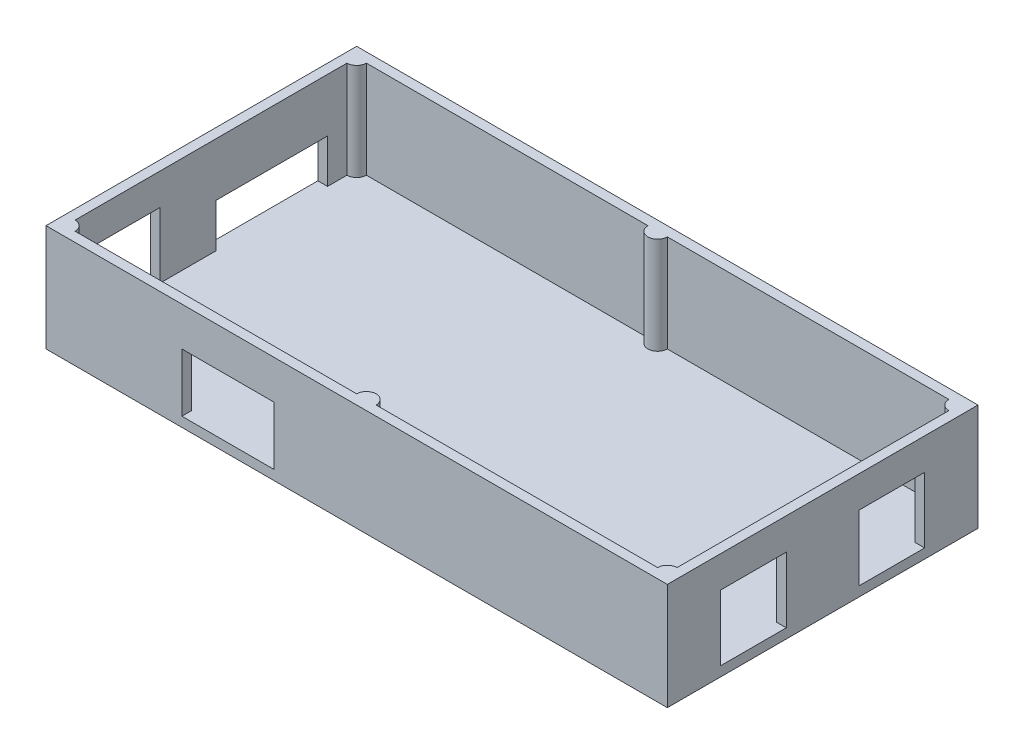
ISO-10303-21;
HEADER;
FILE_DESCRIPTION(('STEP AP214'),'2;1');
FILE_NAME('part.step','',(''),(''),'','','');
FILE_SCHEMA(('AUTOMOTIVE_DESIGN { 1 0 10303 214 1 1 1 1 }'));
ENDSEC;
DATA;
#1=APPLICATION_CONTEXT('core data for automotive mechanical design processes');
#2=APPLICATION_PROTOCOL_DEFINITION('international standard','automotive_design',2000,#1);
#3=PRODUCT_CONTEXT('',#1,'mechanical');
#4=PRODUCT('Part','Part','',(#3));
#5=PRODUCT_RELATED_PRODUCT_CATEGORY('part','',(#4));
#6=PRODUCT_DEFINITION_FORMATION('','',#4);
#7=PRODUCT_DEFINITION_CONTEXT('part definition',#1,'design');
#8=PRODUCT_DEFINITION('design','',#6,#7);
#9=PRODUCT_DEFINITION_SHAPE('','',#8);
#10=(LENGTH_UNIT() NAMED_UNIT(*) SI_UNIT(.MILLI.,.METRE.));
#11=(NAMED_UNIT(*) PLANE_ANGLE_UNIT() SI_UNIT($,.RADIAN.));
#12=(NAMED_UNIT(*) SI_UNIT($,.STERADIAN.) SOLID_ANGLE_UNIT());
#13=UNCERTAINTY_MEASURE_WITH_UNIT(LENGTH_MEASURE(1.E-05),#10,'distance_accuracy_value','');
#14=(GEOMETRIC_REPRESENTATION_CONTEXT(3) GLOBAL_UNCERTAINTY_ASSIGNED_CONTEXT((#13)) GLOBAL_UNIT_ASSIGNED_CONTEXT((#10,
#11,#12)) REPRESENTATION_CONTEXT('',''));
#15=CARTESIAN_POINT('',(0.,0.,0.));
#16=DIRECTION('',(0.,0.,1.));
#17=DIRECTION('',(1.,0.,0.));
#18=AXIS2_PLACEMENT_3D('',#15,#16,#17);
#19=CARTESIAN_POINT('',(0.,22.,30.));
#20=DIRECTION('',(0.,0.,1.));
#21=DIRECTION('',(1.,0.,0.));
#22=AXIS2_PLACEMENT_3D('',#19,#20,#21);
#23=PLANE('',#22);
#24=DIRECTION('',(0.,-1.,0.));
#25=VECTOR('',#24,1.);
#26=CARTESIAN_POINT('',(60.,22.,30.));
#27=LINE('',#26,#25);
#28=CARTESIAN_POINT('',(60.,22.,30.));
#29=VERTEX_POINT('',#28);
#30=CARTESIAN_POINT('',(60.,2.,30.));
#31=VERTEX_POINT('',#30);
#32=EDGE_CURVE('E356',#29,#31,#27,.T.);
#33=ORIENTED_EDGE('',*,*,#32,.T.);
#34=DIRECTION('',(-1.,0.,0.));
#35=VECTOR('',#34,1.);
#36=CARTESIAN_POINT('',(0.,2.,30.));
#37=LINE('',#36,#35);
#38=CARTESIAN_POINT('',(2.,2.,30.));
#39=VERTEX_POINT('',#38);
#40=EDGE_CURVE('E671',#31,#39,#37,.T.);
#41=ORIENTED_EDGE('',*,*,#40,.T.);
#42=DIRECTION('',(0.,-1.,0.));
#43=VECTOR('',#42,1.);
#44=CARTESIAN_POINT('',(2.,22.,30.));
#45=LINE('',#44,#43);
#46=CARTESIAN_POINT('',(2.,22.,30.));
#47=VERTEX_POINT('',#46);
#48=EDGE_CURVE('E11',#47,#39,#45,.T.);
#49=ORIENTED_EDGE('',*,*,#48,.F.);
#50=DIRECTION('',(-1.,0.,0.));
#51=VECTOR('',#50,1.);
#52=CARTESIAN_POINT('',(0.,22.,30.));
#53=LINE('',#52,#51);
#54=EDGE_CURVE('E315',#29,#47,#53,.T.);
#55=ORIENTED_EDGE('',*,*,#54,.F.);
#56=EDGE_LOOP('',(#33,#41,#49,#55));
#57=FACE_BOUND('',#56,.T.);
#58=ADVANCED_FACE('F39',(#57),#23,.F.);
#59=CARTESIAN_POINT('',(0.,22.,30.));
#60=DIRECTION('',(0.,-1.,0.));
#61=DIRECTION('',(0.,0.,-1.));
#62=AXIS2_PLACEMENT_3D('',#59,#60,#61);
#63=CYLINDRICAL_SURFACE('',#62,1.99999999999999);
#64=ORIENTED_EDGE('',*,*,#48,.T.);
#65=CARTESIAN_POINT('',(0.,2.,30.));
#66=DIRECTION('',(0.,1.,0.));
#67=DIRECTION('',(0.,0.,1.));
#68=AXIS2_PLACEMENT_3D('',#65,#66,#67);
#69=CIRCLE('',#68,1.99999999999999);
#70=CARTESIAN_POINT('',(-1.99999999999999,2.,30.));
#71=VERTEX_POINT('',#70);
#72=EDGE_CURVE('E614',#39,#71,#69,.T.);
#73=ORIENTED_EDGE('',*,*,#72,.T.);
#74=DIRECTION('',(0.,-1.,0.));
#75=VECTOR('',#74,1.);
#76=CARTESIAN_POINT('',(-1.99999999999999,22.,30.));
#77=LINE('',#76,#75);
#78=CARTESIAN_POINT('',(-1.99999999999999,22.,30.));
#79=VERTEX_POINT('',#78);
#80=EDGE_CURVE('E48',#79,#71,#77,.T.);
#81=ORIENTED_EDGE('',*,*,#80,.F.);
#82=CARTESIAN_POINT('',(0.,22.,30.));
#83=DIRECTION('',(0.,1.,0.));
#84=DIRECTION('',(0.,0.,1.));
#85=AXIS2_PLACEMENT_3D('',#82,#83,#84);
#86=CIRCLE('',#85,1.99999999999999);
#87=EDGE_CURVE('E318',#47,#79,#86,.T.);
#88=ORIENTED_EDGE('',*,*,#87,.F.);
#89=EDGE_LOOP('',(#64,#73,#81,#88));
#90=FACE_BOUND('',#89,.T.);
#91=ADVANCED_FACE('F421',(#90),#63,.T.);
#92=CARTESIAN_POINT('',(0.,22.,30.));
#93=DIRECTION('',(0.,0.,1.));
#94=DIRECTION('',(1.,0.,0.));
#95=AXIS2_PLACEMENT_3D('',#92,#93,#94);
#96=PLANE('',#95);
#97=DIRECTION('',(-1.,0.,0.));
#98=VECTOR('',#97,1.);
#99=CARTESIAN_POINT('',(-36.,14.,30.));
#100=LINE('',#99,#98);
#101=CARTESIAN_POINT('',(-17.,14.,30.));
#102=VERTEX_POINT('',#101);
#103=CARTESIAN_POINT('',(-36.,14.,30.));
#104=VERTEX_POINT('',#103);
#105=EDGE_CURVE('E282',#102,#104,#100,.T.);
#106=ORIENTED_EDGE('',*,*,#105,.T.);
#107=DIRECTION('',(0.,-1.,0.));
#108=VECTOR('',#107,1.);
#109=CARTESIAN_POINT('',(-36.,2.,30.));
#110=LINE('',#109,#108);
#111=CARTESIAN_POINT('',(-36.,2.,30.));
#112=VERTEX_POINT('',#111);
#113=EDGE_CURVE('E275',#104,#112,#110,.T.);
#114=ORIENTED_EDGE('',*,*,#113,.T.);
#115=DIRECTION('',(-1.,0.,0.));
#116=VECTOR('',#115,1.);
#117=CARTESIAN_POINT('',(0.,2.,30.));
#118=LINE('',#117,#116);
#119=CARTESIAN_POINT('',(-60.,2.,30.));
#120=VERTEX_POINT('',#119);
#121=EDGE_CURVE('E287',#112,#120,#118,.T.);
#122=ORIENTED_EDGE('',*,*,#121,.T.);
#123=DIRECTION('',(0.,-1.,0.));
#124=VECTOR('',#123,1.);
#125=CARTESIAN_POINT('',(-60.,22.,30.));
#126=LINE('',#125,#124);
#127=CARTESIAN_POINT('',(-60.,22.,30.));
#128=VERTEX_POINT('',#127);
#129=EDGE_CURVE('E383',#128,#120,#126,.T.);
#130=ORIENTED_EDGE('',*,*,#129,.F.);
#131=DIRECTION('',(-1.,0.,0.));
#132=VECTOR('',#131,1.);
#133=CARTESIAN_POINT('',(0.,22.,30.));
#134=LINE('',#133,#132);
#135=EDGE_CURVE('E320',#79,#128,#134,.T.);
#136=ORIENTED_EDGE('',*,*,#135,.F.);
#137=ORIENTED_EDGE('',*,*,#80,.T.);
#138=CARTESIAN_POINT('',(-17.,2.,30.));
#139=VERTEX_POINT('',#138);
#140=EDGE_CURVE('E296',#71,#139,#118,.T.);
#141=ORIENTED_EDGE('',*,*,#140,.T.);
#142=DIRECTION('',(0.,1.,0.));
#143=VECTOR('',#142,1.);
#144=CARTESIAN_POINT('',(-17.,2.,30.));
#145=LINE('',#144,#143);
#146=EDGE_CURVE('E64',#139,#102,#145,.T.);
#147=ORIENTED_EDGE('',*,*,#146,.T.);
#148=EDGE_LOOP('',(#106,#114,#122,#130,#136,#137,#141,#147));
#149=FACE_BOUND('',#148,.T.);
#150=ADVANCED_FACE('F285',(#149),#96,.F.);
#151=CARTESIAN_POINT('',(-62.,22.,30.));
#152=DIRECTION('',(0.,-1.,0.));
#153=DIRECTION('',(0.,0.,-1.));
#154=AXIS2_PLACEMENT_3D('',#151,#152,#153);
#155=CYLINDRICAL_SURFACE('',#154,1.99999999999999);
#156=CARTESIAN_POINT('',(-62.,2.,30.));
#157=DIRECTION('',(0.,1.,0.));
#158=DIRECTION('',(0.,0.,1.));
#159=AXIS2_PLACEMENT_3D('',#156,#157,#158);
#160=CIRCLE('',#159,1.99999999999999);
#161=CARTESIAN_POINT('',(-62.,2.,28.));
#162=VERTEX_POINT('',#161);
#163=EDGE_CURVE('E294',#162,#120,#160,.F.);
#164=ORIENTED_EDGE('',*,*,#163,.F.);
#165=DIRECTION('',(0.,-1.,0.));
#166=VECTOR('',#165,1.);
#167=CARTESIAN_POINT('',(-62.,22.,28.));
#168=LINE('',#167,#166);
#169=CARTESIAN_POINT('',(-62.,22.,28.));
#170=VERTEX_POINT('',#169);
#171=EDGE_CURVE('E380',#170,#162,#168,.T.);
#172=ORIENTED_EDGE('',*,*,#171,.F.);
#173=CARTESIAN_POINT('',(-62.,22.,30.));
#174=DIRECTION('',(0.,1.,0.));
#175=DIRECTION('',(0.,0.,1.));
#176=AXIS2_PLACEMENT_3D('',#173,#174,#175);
#177=CIRCLE('',#176,1.99999999999999);
#178=EDGE_CURVE('E322',#170,#128,#177,.F.);
#179=ORIENTED_EDGE('',*,*,#178,.T.);
#180=ORIENTED_EDGE('',*,*,#129,.T.);
#181=EDGE_LOOP('',(#164,#172,#179,#180));
#182=FACE_BOUND('',#181,.T.);
#183=ADVANCED_FACE('F432',(#182),#155,.T.);
#184=CARTESIAN_POINT('',(-62.,22.,0.));
#185=DIRECTION('',(-1.,0.,0.));
#186=DIRECTION('',(0.,0.,1.));
#187=AXIS2_PLACEMENT_3D('',#184,#185,#186);
#188=PLANE('',#187);
#189=DIRECTION('',(0.,0.,-1.));
#190=VECTOR('',#189,1.);
#191=CARTESIAN_POINT('',(-62.,11.,-24.));
#192=LINE('',#191,#190);
#193=CARTESIAN_POINT('',(-62.,11.,-1.));
#194=VERTEX_POINT('',#193);
#195=CARTESIAN_POINT('',(-62.,11.,-24.));
#196=VERTEX_POINT('',#195);
#197=EDGE_CURVE('E560',#194,#196,#192,.T.);
#198=ORIENTED_EDGE('',*,*,#197,.T.);
#199=DIRECTION('',(0.,-1.,0.));
#200=VECTOR('',#199,1.);
#201=CARTESIAN_POINT('',(-62.,2.,-24.));
#202=LINE('',#201,#200);
#203=CARTESIAN_POINT('',(-62.,2.,-24.));
#204=VERTEX_POINT('',#203);
#205=EDGE_CURVE('E553',#196,#204,#202,.T.);
#206=ORIENTED_EDGE('',*,*,#205,.T.);
#207=DIRECTION('',(0.,0.,-1.));
#208=VECTOR('',#207,1.);
#209=CARTESIAN_POINT('',(-62.,2.,0.));
#210=LINE('',#209,#208);
#211=CARTESIAN_POINT('',(-62.,2.,-28.));
#212=VERTEX_POINT('',#211);
#213=EDGE_CURVE('E692',#204,#212,#210,.T.);
#214=ORIENTED_EDGE('',*,*,#213,.T.);
#215=DIRECTION('',(0.,-1.,0.));
#216=VECTOR('',#215,1.);
#217=CARTESIAN_POINT('',(-62.,22.,-28.));
#218=LINE('',#217,#216);
#219=CARTESIAN_POINT('',(-62.,22.,-28.));
#220=VERTEX_POINT('',#219);
#221=EDGE_CURVE('E377',#220,#212,#218,.T.);
#222=ORIENTED_EDGE('',*,*,#221,.F.);
#223=DIRECTION('',(0.,0.,-1.));
#224=VECTOR('',#223,1.);
#225=CARTESIAN_POINT('',(-62.,22.,0.));
#226=LINE('',#225,#224);
#227=EDGE_CURVE('E325',#170,#220,#226,.T.);
#228=ORIENTED_EDGE('',*,*,#227,.F.);
#229=ORIENTED_EDGE('',*,*,#171,.T.);
#230=CARTESIAN_POINT('',(-62.,2.,24.));
#231=VERTEX_POINT('',#230);
#232=EDGE_CURVE('E300',#162,#231,#210,.T.);
#233=ORIENTED_EDGE('',*,*,#232,.T.);
#234=DIRECTION('',(0.,1.,0.));
#235=VECTOR('',#234,1.);
#236=CARTESIAN_POINT('',(-62.,2.00000000000001,24.));
#237=LINE('',#236,#235);
#238=CARTESIAN_POINT('',(-62.,15.5,24.));
#239=VERTEX_POINT('',#238);
#240=EDGE_CURVE('E587',#231,#239,#237,.T.);
#241=ORIENTED_EDGE('',*,*,#240,.T.);
#242=DIRECTION('',(0.,0.,-1.));
#243=VECTOR('',#242,1.);
#244=CARTESIAN_POINT('',(-62.,15.5,10.5));
#245=LINE('',#244,#243);
#246=CARTESIAN_POINT('',(-62.,15.5,10.5));
#247=VERTEX_POINT('',#246);
#248=EDGE_CURVE('E591',#239,#247,#245,.T.);
#249=ORIENTED_EDGE('',*,*,#248,.T.);
#250=DIRECTION('',(0.,-1.,0.));
#251=VECTOR('',#250,1.);
#252=CARTESIAN_POINT('',(-62.,2.,10.5));
#253=LINE('',#252,#251);
#254=CARTESIAN_POINT('',(-62.,2.,10.5));
#255=VERTEX_POINT('',#254);
#256=EDGE_CURVE('E584',#247,#255,#253,.T.);
#257=ORIENTED_EDGE('',*,*,#256,.T.);
#258=CARTESIAN_POINT('',(-62.,2.,-1.));
#259=VERTEX_POINT('',#258);
#260=EDGE_CURVE('E694',#255,#259,#210,.T.);
#261=ORIENTED_EDGE('',*,*,#260,.T.);
#262=DIRECTION('',(0.,1.,0.));
#263=VECTOR('',#262,1.);
#264=CARTESIAN_POINT('',(-62.,2.,-1.));
#265=LINE('',#264,#263);
#266=EDGE_CURVE('E556',#259,#194,#265,.T.);
#267=ORIENTED_EDGE('',*,*,#266,.T.);
#268=EDGE_LOOP('',(#198,#206,#214,#222,#228,#229,#233,#241,#249,#257,#261,#267));
#269=FACE_BOUND('',#268,.T.);
#270=ADVANCED_FACE('F435',(#269),#188,.F.);
#271=CARTESIAN_POINT('',(-62.,22.,-30.));
#272=DIRECTION('',(0.,-1.,0.));
#273=DIRECTION('',(0.,0.,-1.));
#274=AXIS2_PLACEMENT_3D('',#271,#272,#273);
#275=CYLINDRICAL_SURFACE('',#274,2.);
#276=ORIENTED_EDGE('',*,*,#221,.T.);
#277=CARTESIAN_POINT('',(-62.,2.,-30.));
#278=DIRECTION('',(0.,1.,0.));
#279=DIRECTION('',(0.,0.,1.));
#280=AXIS2_PLACEMENT_3D('',#277,#278,#279);
#281=CIRCLE('',#280,2.);
#282=CARTESIAN_POINT('',(-60.,2.,-30.));
#283=VERTEX_POINT('',#282);
#284=EDGE_CURVE('E690',#212,#283,#281,.T.);
#285=ORIENTED_EDGE('',*,*,#284,.T.);
#286=DIRECTION('',(0.,-1.,0.));
#287=VECTOR('',#286,1.);
#288=CARTESIAN_POINT('',(-60.,22.,-30.));
#289=LINE('',#288,#287);
#290=CARTESIAN_POINT('',(-60.,22.,-30.));
#291=VERTEX_POINT('',#290);
#292=EDGE_CURVE('E374',#291,#283,#289,.T.);
#293=ORIENTED_EDGE('',*,*,#292,.F.);
#294=CARTESIAN_POINT('',(-62.,22.,-30.));
#295=DIRECTION('',(0.,1.,0.));
#296=DIRECTION('',(0.,0.,1.));
#297=AXIS2_PLACEMENT_3D('',#294,#295,#296);
#298=CIRCLE('',#297,2.);
#299=EDGE_CURVE('E327',#220,#291,#298,.T.);
#300=ORIENTED_EDGE('',*,*,#299,.F.);
#301=EDGE_LOOP('',(#276,#285,#293,#300));
#302=FACE_BOUND('',#301,.T.);
#303=ADVANCED_FACE('F439',(#302),#275,.T.);
#304=CARTESIAN_POINT('',(0.,22.,-30.));
#305=DIRECTION('',(0.,0.,1.));
#306=DIRECTION('',(1.,0.,0.));
#307=AXIS2_PLACEMENT_3D('',#304,#305,#306);
#308=PLANE('',#307);
#309=DIRECTION('',(-1.,0.,0.));
#310=VECTOR('',#309,1.);
#311=CARTESIAN_POINT('',(0.,2.,-30.));
#312=LINE('',#311,#310);
#313=CARTESIAN_POINT('',(-2.,2.,-30.));
#314=VERTEX_POINT('',#313);
#315=EDGE_CURVE('E688',#314,#283,#312,.T.);
#316=ORIENTED_EDGE('',*,*,#315,.F.);
#317=DIRECTION('',(0.,-1.,0.));
#318=VECTOR('',#317,1.);
#319=CARTESIAN_POINT('',(-2.,22.,-30.));
#320=LINE('',#319,#318);
#321=CARTESIAN_POINT('',(-2.,22.,-30.));
#322=VERTEX_POINT('',#321);
#323=EDGE_CURVE('E371',#322,#314,#320,.T.);
#324=ORIENTED_EDGE('',*,*,#323,.F.);
#325=DIRECTION('',(-1.,0.,0.));
#326=VECTOR('',#325,1.);
#327=CARTESIAN_POINT('',(0.,22.,-30.));
#328=LINE('',#327,#326);
#329=EDGE_CURVE('E329',#322,#291,#328,.T.);
#330=ORIENTED_EDGE('',*,*,#329,.T.);
#331=ORIENTED_EDGE('',*,*,#292,.T.);
#332=EDGE_LOOP('',(#316,#324,#330,#331));
#333=FACE_BOUND('',#332,.T.);
#334=ADVANCED_FACE('F443',(#333),#308,.T.);
#335=CARTESIAN_POINT('',(0.,22.,-30.));
#336=DIRECTION('',(0.,-1.,0.));
#337=DIRECTION('',(0.,0.,-1.));
#338=AXIS2_PLACEMENT_3D('',#335,#336,#337);
#339=CYLINDRICAL_SURFACE('',#338,2.);
#340=CARTESIAN_POINT('',(0.,2.,-30.));
#341=DIRECTION('',(0.,1.,0.));
#342=DIRECTION('',(0.,0.,1.));
#343=AXIS2_PLACEMENT_3D('',#340,#341,#342);
#344=CIRCLE('',#343,2.);
#345=CARTESIAN_POINT('',(2.,2.,-30.));
#346=VERTEX_POINT('',#345);
#347=EDGE_CURVE('E686',#346,#314,#344,.F.);
#348=ORIENTED_EDGE('',*,*,#347,.F.);
#349=DIRECTION('',(0.,-1.,0.));
#350=VECTOR('',#349,1.);
#351=CARTESIAN_POINT('',(2.,22.,-30.));
#352=LINE('',#351,#350);
#353=CARTESIAN_POINT('',(2.,22.,-30.));
#354=VERTEX_POINT('',#353);
#355=EDGE_CURVE('E368',#354,#346,#352,.T.);
#356=ORIENTED_EDGE('',*,*,#355,.F.);
#357=CARTESIAN_POINT('',(0.,22.,-30.));
#358=DIRECTION('',(0.,1.,0.));
#359=DIRECTION('',(0.,0.,1.));
#360=AXIS2_PLACEMENT_3D('',#357,#358,#359);
#361=CIRCLE('',#360,2.);
#362=EDGE_CURVE('E332',#354,#322,#361,.F.);
#363=ORIENTED_EDGE('',*,*,#362,.T.);
#364=ORIENTED_EDGE('',*,*,#323,.T.);
#365=EDGE_LOOP('',(#348,#356,#363,#364));
#366=FACE_BOUND('',#365,.T.);
#367=ADVANCED_FACE('F447',(#366),#339,.T.);
#368=CARTESIAN_POINT('',(0.,22.,-30.));
#369=DIRECTION('',(0.,0.,1.));
#370=DIRECTION('',(1.,0.,0.));
#371=AXIS2_PLACEMENT_3D('',#368,#369,#370);
#372=PLANE('',#371);
#373=DIRECTION('',(-1.,0.,0.));
#374=VECTOR('',#373,1.);
#375=CARTESIAN_POINT('',(0.,2.,-30.));
#376=LINE('',#375,#374);
#377=CARTESIAN_POINT('',(60.,2.,-30.));
#378=VERTEX_POINT('',#377);
#379=EDGE_CURVE('E684',#378,#346,#376,.T.);
#380=ORIENTED_EDGE('',*,*,#379,.F.);
#381=DIRECTION('',(0.,-1.,0.));
#382=VECTOR('',#381,1.);
#383=CARTESIAN_POINT('',(60.,22.,-30.));
#384=LINE('',#383,#382);
#385=CARTESIAN_POINT('',(60.,22.,-30.));
#386=VERTEX_POINT('',#385);
#387=EDGE_CURVE('E365',#386,#378,#384,.T.);
#388=ORIENTED_EDGE('',*,*,#387,.F.);
#389=DIRECTION('',(-1.,0.,0.));
#390=VECTOR('',#389,1.);
#391=CARTESIAN_POINT('',(0.,22.,-30.));
#392=LINE('',#391,#390);
#393=EDGE_CURVE('E335',#386,#354,#392,.T.);
#394=ORIENTED_EDGE('',*,*,#393,.T.);
#395=ORIENTED_EDGE('',*,*,#355,.T.);
#396=EDGE_LOOP('',(#380,#388,#394,#395));
#397=FACE_BOUND('',#396,.T.);
#398=ADVANCED_FACE('F451',(#397),#372,.T.);
#399=CARTESIAN_POINT('',(62.,22.,-30.));
#400=DIRECTION('',(0.,-1.,0.));
#401=DIRECTION('',(0.,0.,-1.));
#402=AXIS2_PLACEMENT_3D('',#399,#400,#401);
#403=CYLINDRICAL_SURFACE('',#402,1.99999999999999);
#404=CARTESIAN_POINT('',(62.,2.,-30.));
#405=DIRECTION('',(0.,1.,0.));
#406=DIRECTION('',(0.,0.,1.));
#407=AXIS2_PLACEMENT_3D('',#404,#405,#406);
#408=CIRCLE('',#407,1.99999999999999);
#409=CARTESIAN_POINT('',(62.,2.,-28.));
#410=VERTEX_POINT('',#409);
#411=EDGE_CURVE('E681',#410,#378,#408,.F.);
#412=ORIENTED_EDGE('',*,*,#411,.F.);
#413=DIRECTION('',(0.,-1.,0.));
#414=VECTOR('',#413,1.);
#415=CARTESIAN_POINT('',(62.,22.,-28.));
#416=LINE('',#415,#414);
#417=CARTESIAN_POINT('',(62.,22.,-28.));
#418=VERTEX_POINT('',#417);
#419=EDGE_CURVE('E362',#418,#410,#416,.T.);
#420=ORIENTED_EDGE('',*,*,#419,.F.);
#421=CARTESIAN_POINT('',(62.,22.,-30.));
#422=DIRECTION('',(0.,1.,0.));
#423=DIRECTION('',(0.,0.,1.));
#424=AXIS2_PLACEMENT_3D('',#421,#422,#423);
#425=CIRCLE('',#424,1.99999999999999);
#426=EDGE_CURVE('E338',#418,#386,#425,.F.);
#427=ORIENTED_EDGE('',*,*,#426,.T.);
#428=ORIENTED_EDGE('',*,*,#387,.T.);
#429=EDGE_LOOP('',(#412,#420,#427,#428));
#430=FACE_BOUND('',#429,.T.);
#431=ADVANCED_FACE('F455',(#430),#403,.T.);
#432=CARTESIAN_POINT('',(62.,22.,0.));
#433=DIRECTION('',(-1.,0.,0.));
#434=DIRECTION('',(0.,0.,1.));
#435=AXIS2_PLACEMENT_3D('',#432,#433,#434);
#436=PLANE('',#435);
#437=DIRECTION('',(0.,-1.,0.));
#438=VECTOR('',#437,1.);
#439=CARTESIAN_POINT('',(62.,2.,21.));
#440=LINE('',#439,#438);
#441=CARTESIAN_POINT('',(62.,15.5,21.));
#442=VERTEX_POINT('',#441);
#443=CARTESIAN_POINT('',(62.,2.,21.));
#444=VERTEX_POINT('',#443);
#445=EDGE_CURVE('E624',#442,#444,#440,.T.);
#446=ORIENTED_EDGE('',*,*,#445,.T.);
#447=DIRECTION('',(0.,0.,-1.));
#448=VECTOR('',#447,1.);
#449=CARTESIAN_POINT('',(62.,2.,0.));
#450=LINE('',#449,#448);
#451=CARTESIAN_POINT('',(62.,2.,28.));
#452=VERTEX_POINT('',#451);
#453=EDGE_CURVE('E678',#452,#444,#450,.T.);
#454=ORIENTED_EDGE('',*,*,#453,.F.);
#455=DIRECTION('',(0.,-1.,0.));
#456=VECTOR('',#455,1.);
#457=CARTESIAN_POINT('',(62.,22.,28.));
#458=LINE('',#457,#456);
#459=CARTESIAN_POINT('',(62.,22.,28.));
#460=VERTEX_POINT('',#459);
#461=EDGE_CURVE('E359',#460,#452,#458,.T.);
#462=ORIENTED_EDGE('',*,*,#461,.F.);
#463=DIRECTION('',(0.,0.,-1.));
#464=VECTOR('',#463,1.);
#465=CARTESIAN_POINT('',(62.,22.,0.));
#466=LINE('',#465,#464);
#467=EDGE_CURVE('E341',#460,#418,#466,.T.);
#468=ORIENTED_EDGE('',*,*,#467,.T.);
#469=ORIENTED_EDGE('',*,*,#419,.T.);
#470=CARTESIAN_POINT('',(62.,2.,-21.));
#471=VERTEX_POINT('',#470);
#472=EDGE_CURVE('E677',#471,#410,#450,.T.);
#473=ORIENTED_EDGE('',*,*,#472,.F.);
#474=DIRECTION('',(0.,1.,0.));
#475=VECTOR('',#474,1.);
#476=CARTESIAN_POINT('',(62.,2.,-21.));
#477=LINE('',#476,#475);
#478=CARTESIAN_POINT('',(62.,15.5,-21.));
#479=VERTEX_POINT('',#478);
#480=EDGE_CURVE('E642',#471,#479,#477,.T.);
#481=ORIENTED_EDGE('',*,*,#480,.T.);
#482=DIRECTION('',(0.,0.,1.));
#483=VECTOR('',#482,1.);
#484=CARTESIAN_POINT('',(62.,15.5,-21.));
#485=LINE('',#484,#483);
#486=CARTESIAN_POINT('',(62.,15.5,-7.50000000000001));
#487=VERTEX_POINT('',#486);
#488=EDGE_CURVE('E661',#479,#487,#485,.T.);
#489=ORIENTED_EDGE('',*,*,#488,.T.);
#490=DIRECTION('',(0.,-1.,0.));
#491=VECTOR('',#490,1.);
#492=CARTESIAN_POINT('',(62.,2.,-7.50000000000001));
#493=LINE('',#492,#491);
#494=CARTESIAN_POINT('',(62.,2.,-7.50000000000001));
#495=VERTEX_POINT('',#494);
#496=EDGE_CURVE('E657',#487,#495,#493,.T.);
#497=ORIENTED_EDGE('',*,*,#496,.T.);
#498=CARTESIAN_POINT('',(62.,2.,7.49999999999998));
#499=VERTEX_POINT('',#498);
#500=EDGE_CURVE('E682',#499,#495,#450,.T.);
#501=ORIENTED_EDGE('',*,*,#500,.F.);
#502=DIRECTION('',(0.,1.,0.));
#503=VECTOR('',#502,1.);
#504=CARTESIAN_POINT('',(62.,2.,7.49999999999998));
#505=LINE('',#504,#503);
#506=CARTESIAN_POINT('',(62.,15.5,7.49999999999998));
#507=VERTEX_POINT('',#506);
#508=EDGE_CURVE('E633',#499,#507,#505,.T.);
#509=ORIENTED_EDGE('',*,*,#508,.T.);
#510=DIRECTION('',(0.,0.,1.));
#511=VECTOR('',#510,1.);
#512=CARTESIAN_POINT('',(62.,15.5,21.));
#513=LINE('',#512,#511);
#514=EDGE_CURVE('E629',#507,#442,#513,.T.);
#515=ORIENTED_EDGE('',*,*,#514,.T.);
#516=EDGE_LOOP('',(#446,#454,#462,#468,#469,#473,#481,#489,#497,#501,#509,#515));
#517=FACE_BOUND('',#516,.T.);
#518=ADVANCED_FACE('F459',(#517),#436,.T.);
#519=CARTESIAN_POINT('',(0.,22.,32.));
#520=DIRECTION('',(0.,0.,1.));
#521=DIRECTION('',(1.,0.,0.));
#522=AXIS2_PLACEMENT_3D('',#519,#520,#521);
#523=PLANE('',#522);
#524=DIRECTION('',(0.,-1.,0.));
#525=VECTOR('',#524,1.);
#526=CARTESIAN_POINT('',(-36.,2.,32.));
#527=LINE('',#526,#525);
#528=CARTESIAN_POINT('',(-36.,14.,32.));
#529=VERTEX_POINT('',#528);
#530=CARTESIAN_POINT('',(-36.,1.99999999999999,32.));
#531=VERTEX_POINT('',#530);
#532=EDGE_CURVE('E56',#529,#531,#527,.T.);
#533=ORIENTED_EDGE('',*,*,#532,.F.);
#534=DIRECTION('',(-1.,0.,0.));
#535=VECTOR('',#534,1.);
#536=CARTESIAN_POINT('',(-36.,14.,32.));
#537=LINE('',#536,#535);
#538=CARTESIAN_POINT('',(-17.,14.,32.));
#539=VERTEX_POINT('',#538);
#540=EDGE_CURVE('E290',#539,#529,#537,.T.);
#541=ORIENTED_EDGE('',*,*,#540,.F.);
#542=DIRECTION('',(0.,1.,0.));
#543=VECTOR('',#542,1.);
#544=CARTESIAN_POINT('',(-17.,2.,32.));
#545=LINE('',#544,#543);
#546=CARTESIAN_POINT('',(-17.,2.,32.));
#547=VERTEX_POINT('',#546);
#548=EDGE_CURVE('E540',#547,#539,#545,.T.);
#549=ORIENTED_EDGE('',*,*,#548,.F.);
#550=DIRECTION('',(1.,0.,0.));
#551=VECTOR('',#550,1.);
#552=CARTESIAN_POINT('',(-36.,2.,32.));
#553=LINE('',#552,#551);
#554=EDGE_CURVE('E542',#531,#547,#553,.T.);
#555=ORIENTED_EDGE('',*,*,#554,.F.);
#556=EDGE_LOOP('',(#533,#541,#549,#555));
#557=FACE_BOUND('',#556,.T.);
#558=DIRECTION('',(-1.,0.,0.));
#559=VECTOR('',#558,1.);
#560=CARTESIAN_POINT('',(0.,0.,32.));
#561=LINE('',#560,#559);
#562=CARTESIAN_POINT('',(64.,0.,32.));
#563=VERTEX_POINT('',#562);
#564=CARTESIAN_POINT('',(-64.,0.,32.));
#565=VERTEX_POINT('',#564);
#566=EDGE_CURVE('E299',#563,#565,#561,.T.);
#567=ORIENTED_EDGE('',*,*,#566,.F.);
#568=DIRECTION('',(0.,-1.,0.));
#569=VECTOR('',#568,1.);
#570=CARTESIAN_POINT('',(64.,22.,32.));
#571=LINE('',#570,#569);
#572=CARTESIAN_POINT('',(64.,22.,32.));
#573=VERTEX_POINT('',#572);
#574=EDGE_CURVE('E43',#573,#563,#571,.T.);
#575=ORIENTED_EDGE('',*,*,#574,.F.);
#576=DIRECTION('',(-1.,0.,0.));
#577=VECTOR('',#576,1.);
#578=CARTESIAN_POINT('',(0.,22.,32.));
#579=LINE('',#578,#577);
#580=CARTESIAN_POINT('',(-64.,22.,32.));
#581=VERTEX_POINT('',#580);
#582=EDGE_CURVE('E304',#573,#581,#579,.T.);
#583=ORIENTED_EDGE('',*,*,#582,.T.);
#584=DIRECTION('',(0.,-1.,0.));
#585=VECTOR('',#584,1.);
#586=CARTESIAN_POINT('',(-64.,22.,32.));
#587=LINE('',#586,#585);
#588=EDGE_CURVE('E346',#581,#565,#587,.T.);
#589=ORIENTED_EDGE('',*,*,#588,.T.);
#590=EDGE_LOOP('',(#567,#575,#583,#589));
#591=FACE_BOUND('',#590,.T.);
#592=ADVANCED_FACE('F41',(#557,#591),#523,.T.);
#593=CARTESIAN_POINT('',(64.,22.,0.));
#594=DIRECTION('',(-1.,0.,0.));
#595=DIRECTION('',(0.,0.,1.));
#596=AXIS2_PLACEMENT_3D('',#593,#594,#595);
#597=PLANE('',#596);
#598=DIRECTION('',(0.,0.,-1.));
#599=VECTOR('',#598,1.);
#600=CARTESIAN_POINT('',(64.,2.,21.));
#601=LINE('',#600,#599);
#602=CARTESIAN_POINT('',(64.,2.,21.));
#603=VERTEX_POINT('',#602);
#604=CARTESIAN_POINT('',(64.,2.,7.49999999999998));
#605=VERTEX_POINT('',#604);
#606=EDGE_CURVE('E618',#603,#605,#601,.T.);
#607=ORIENTED_EDGE('',*,*,#606,.F.);
#608=DIRECTION('',(0.,-1.,0.));
#609=VECTOR('',#608,1.);
#610=CARTESIAN_POINT('',(64.,2.,21.));
#611=LINE('',#610,#609);
#612=CARTESIAN_POINT('',(64.,15.5,21.));
#613=VERTEX_POINT('',#612);
#614=EDGE_CURVE('E621',#613,#603,#611,.T.);
#615=ORIENTED_EDGE('',*,*,#614,.F.);
#616=DIRECTION('',(0.,0.,1.));
#617=VECTOR('',#616,1.);
#618=CARTESIAN_POINT('',(64.,15.5,21.));
#619=LINE('',#618,#617);
#620=CARTESIAN_POINT('',(64.,15.5,7.49999999999998));
#621=VERTEX_POINT('',#620);
#622=EDGE_CURVE('E611',#621,#613,#619,.T.);
#623=ORIENTED_EDGE('',*,*,#622,.F.);
#624=DIRECTION('',(0.,1.,0.));
#625=VECTOR('',#624,1.);
#626=CARTESIAN_POINT('',(64.,2.,7.49999999999998));
#627=LINE('',#626,#625);
#628=EDGE_CURVE('E615',#605,#621,#627,.T.);
#629=ORIENTED_EDGE('',*,*,#628,.F.);
#630=EDGE_LOOP('',(#607,#615,#623,#629));
#631=FACE_BOUND('',#630,.T.);
#632=DIRECTION('',(0.,1.,0.));
#633=VECTOR('',#632,1.);
#634=CARTESIAN_POINT('',(64.,2.,-21.));
#635=LINE('',#634,#633);
#636=CARTESIAN_POINT('',(64.,2.00000000000001,-21.));
#637=VERTEX_POINT('',#636);
#638=CARTESIAN_POINT('',(64.,15.5,-21.));
#639=VERTEX_POINT('',#638);
#640=EDGE_CURVE('E652',#637,#639,#635,.T.);
#641=ORIENTED_EDGE('',*,*,#640,.F.);
#642=DIRECTION('',(0.,0.,-1.));
#643=VECTOR('',#642,1.);
#644=CARTESIAN_POINT('',(64.,2.,-21.));
#645=LINE('',#644,#643);
#646=CARTESIAN_POINT('',(64.,2.,-7.50000000000001));
#647=VERTEX_POINT('',#646);
#648=EDGE_CURVE('E655',#647,#637,#645,.T.);
#649=ORIENTED_EDGE('',*,*,#648,.F.);
#650=DIRECTION('',(0.,-1.,0.));
#651=VECTOR('',#650,1.);
#652=CARTESIAN_POINT('',(64.,2.,-7.50000000000001));
#653=LINE('',#652,#651);
#654=CARTESIAN_POINT('',(64.,15.5,-7.50000000000001));
#655=VERTEX_POINT('',#654);
#656=EDGE_CURVE('E628',#655,#647,#653,.T.);
#657=ORIENTED_EDGE('',*,*,#656,.F.);
#658=DIRECTION('',(0.,0.,1.));
#659=VECTOR('',#658,1.);
#660=CARTESIAN_POINT('',(64.,15.5,-21.));
#661=LINE('',#660,#659);
#662=EDGE_CURVE('E649',#639,#655,#661,.T.);
#663=ORIENTED_EDGE('',*,*,#662,.F.);
#664=EDGE_LOOP('',(#641,#649,#657,#663));
#665=FACE_BOUND('',#664,.T.);
#666=DIRECTION('',(0.,0.,-1.));
#667=VECTOR('',#666,1.);
#668=CARTESIAN_POINT('',(64.,0.,0.));
#669=LINE('',#668,#667);
#670=CARTESIAN_POINT('',(64.,0.,-32.));
#671=VERTEX_POINT('',#670);
#672=EDGE_CURVE('E349',#563,#671,#669,.T.);
#673=ORIENTED_EDGE('',*,*,#672,.T.);
#674=DIRECTION('',(0.,-1.,0.));
#675=VECTOR('',#674,1.);
#676=CARTESIAN_POINT('',(64.,22.,-32.));
#677=LINE('',#676,#675);
#678=CARTESIAN_POINT('',(64.,22.,-32.));
#679=VERTEX_POINT('',#678);
#680=EDGE_CURVE('E389',#679,#671,#677,.T.);
#681=ORIENTED_EDGE('',*,*,#680,.F.);
#682=DIRECTION('',(0.,0.,-1.));
#683=VECTOR('',#682,1.);
#684=CARTESIAN_POINT('',(64.,22.,0.));
#685=LINE('',#684,#683);
#686=EDGE_CURVE('E307',#573,#679,#685,.T.);
#687=ORIENTED_EDGE('',*,*,#686,.F.);
#688=ORIENTED_EDGE('',*,*,#574,.T.);
#689=EDGE_LOOP('',(#673,#681,#687,#688));
#690=FACE_BOUND('',#689,.T.);
#691=ADVANCED_FACE('F398',(#631,#665,#690),#597,.F.);
#692=CARTESIAN_POINT('',(0.,22.,-32.));
#693=DIRECTION('',(0.,0.,1.));
#694=DIRECTION('',(1.,0.,0.));
#695=AXIS2_PLACEMENT_3D('',#692,#693,#694);
#696=PLANE('',#695);
#697=DIRECTION('',(-1.,0.,0.));
#698=VECTOR('',#697,1.);
#699=CARTESIAN_POINT('',(0.,0.,-32.));
#700=LINE('',#699,#698);
#701=CARTESIAN_POINT('',(-64.,0.,-32.));
#702=VERTEX_POINT('',#701);
#703=EDGE_CURVE('E351',#671,#702,#700,.T.);
#704=ORIENTED_EDGE('',*,*,#703,.T.);
#705=DIRECTION('',(0.,-1.,0.));
#706=VECTOR('',#705,1.);
#707=CARTESIAN_POINT('',(-64.,22.,-32.));
#708=LINE('',#707,#706);
#709=CARTESIAN_POINT('',(-64.,22.,-32.));
#710=VERTEX_POINT('',#709);
#711=EDGE_CURVE('E388',#710,#702,#708,.T.);
#712=ORIENTED_EDGE('',*,*,#711,.F.);
#713=DIRECTION('',(-1.,0.,0.));
#714=VECTOR('',#713,1.);
#715=CARTESIAN_POINT('',(0.,22.,-32.));
#716=LINE('',#715,#714);
#717=EDGE_CURVE('E310',#679,#710,#716,.T.);
#718=ORIENTED_EDGE('',*,*,#717,.F.);
#719=ORIENTED_EDGE('',*,*,#680,.T.);
#720=EDGE_LOOP('',(#704,#712,#718,#719));
#721=FACE_BOUND('',#720,.T.);
#722=ADVANCED_FACE('F409',(#721),#696,.F.);
#723=CARTESIAN_POINT('',(-64.,22.,0.));
#724=DIRECTION('',(-1.,0.,0.));
#725=DIRECTION('',(0.,0.,1.));
#726=AXIS2_PLACEMENT_3D('',#723,#724,#725);
#727=PLANE('',#726);
#728=DIRECTION('',(0.,-1.,0.));
#729=VECTOR('',#728,1.);
#730=CARTESIAN_POINT('',(-64.,2.,-24.));
#731=LINE('',#730,#729);
#732=CARTESIAN_POINT('',(-64.,11.,-24.));
#733=VERTEX_POINT('',#732);
#734=CARTESIAN_POINT('',(-64.,2.,-24.));
#735=VERTEX_POINT('',#734);
#736=EDGE_CURVE('E564',#733,#735,#731,.T.);
#737=ORIENTED_EDGE('',*,*,#736,.F.);
#738=DIRECTION('',(0.,0.,-1.));
#739=VECTOR('',#738,1.);
#740=CARTESIAN_POINT('',(-64.,11.,-24.));
#741=LINE('',#740,#739);
#742=CARTESIAN_POINT('',(-64.,11.,-1.));
#743=VERTEX_POINT('',#742);
#744=EDGE_CURVE('E557',#743,#733,#741,.T.);
#745=ORIENTED_EDGE('',*,*,#744,.F.);
#746=DIRECTION('',(0.,1.,0.));
#747=VECTOR('',#746,1.);
#748=CARTESIAN_POINT('',(-64.,2.,-1.));
#749=LINE('',#748,#747);
#750=CARTESIAN_POINT('',(-64.,2.,-1.));
#751=VERTEX_POINT('',#750);
#752=EDGE_CURVE('E570',#751,#743,#749,.T.);
#753=ORIENTED_EDGE('',*,*,#752,.F.);
#754=DIRECTION('',(0.,0.,1.));
#755=VECTOR('',#754,1.);
#756=CARTESIAN_POINT('',(-64.,2.,-24.));
#757=LINE('',#756,#755);
#758=EDGE_CURVE('E566',#735,#751,#757,.T.);
#759=ORIENTED_EDGE('',*,*,#758,.F.);
#760=EDGE_LOOP('',(#737,#745,#753,#759));
#761=FACE_BOUND('',#760,.T.);
#762=DIRECTION('',(0.,-1.,0.));
#763=VECTOR('',#762,1.);
#764=CARTESIAN_POINT('',(-64.,2.,10.5));
#765=LINE('',#764,#763);
#766=CARTESIAN_POINT('',(-64.,15.5,10.5));
#767=VERTEX_POINT('',#766);
#768=CARTESIAN_POINT('',(-64.,2.,10.5));
#769=VERTEX_POINT('',#768);
#770=EDGE_CURVE('E550',#767,#769,#765,.T.);
#771=ORIENTED_EDGE('',*,*,#770,.F.);
#772=DIRECTION('',(0.,0.,-1.));
#773=VECTOR('',#772,1.);
#774=CARTESIAN_POINT('',(-64.,15.5,10.5));
#775=LINE('',#774,#773);
#776=CARTESIAN_POINT('',(-64.,15.5,24.));
#777=VERTEX_POINT('',#776);
#778=EDGE_CURVE('E588',#777,#767,#775,.T.);
#779=ORIENTED_EDGE('',*,*,#778,.F.);
#780=DIRECTION('',(0.,1.,0.));
#781=VECTOR('',#780,1.);
#782=CARTESIAN_POINT('',(-64.,2.00000000000001,24.));
#783=LINE('',#782,#781);
#784=CARTESIAN_POINT('',(-64.,2.00000000000001,24.));
#785=VERTEX_POINT('',#784);
#786=EDGE_CURVE('E599',#785,#777,#783,.T.);
#787=ORIENTED_EDGE('',*,*,#786,.F.);
#788=DIRECTION('',(0.,0.,1.));
#789=VECTOR('',#788,1.);
#790=CARTESIAN_POINT('',(-64.,2.,10.5));
#791=LINE('',#790,#789);
#792=EDGE_CURVE('E596',#769,#785,#791,.T.);
#793=ORIENTED_EDGE('',*,*,#792,.F.);
#794=EDGE_LOOP('',(#771,#779,#787,#793));
#795=FACE_BOUND('',#794,.T.);
#796=DIRECTION('',(0.,0.,-1.));
#797=VECTOR('',#796,1.);
#798=CARTESIAN_POINT('',(-64.,0.,0.));
#799=LINE('',#798,#797);
#800=EDGE_CURVE('E308',#565,#702,#799,.T.);
#801=ORIENTED_EDGE('',*,*,#800,.F.);
#802=ORIENTED_EDGE('',*,*,#588,.F.);
#803=DIRECTION('',(0.,0.,-1.));
#804=VECTOR('',#803,1.);
#805=CARTESIAN_POINT('',(-64.,22.,0.));
#806=LINE('',#805,#804);
#807=EDGE_CURVE('E312',#581,#710,#806,.T.);
#808=ORIENTED_EDGE('',*,*,#807,.T.);
#809=ORIENTED_EDGE('',*,*,#711,.T.);
#810=EDGE_LOOP('',(#801,#802,#808,#809));
#811=FACE_BOUND('',#810,.T.);
#812=ADVANCED_FACE('F407',(#761,#795,#811),#727,.T.);
#813=CARTESIAN_POINT('',(62.,22.,30.));
#814=DIRECTION('',(0.,-1.,0.));
#815=DIRECTION('',(0.,0.,-1.));
#816=AXIS2_PLACEMENT_3D('',#813,#814,#815);
#817=CYLINDRICAL_SURFACE('',#816,1.99999999999999);
#818=ORIENTED_EDGE('',*,*,#461,.T.);
#819=CARTESIAN_POINT('',(62.,2.,30.));
#820=DIRECTION('',(0.,1.,0.));
#821=DIRECTION('',(0.,0.,1.));
#822=AXIS2_PLACEMENT_3D('',#819,#820,#821);
#823=CIRCLE('',#822,1.99999999999999);
#824=EDGE_CURVE('E674',#452,#31,#823,.T.);
#825=ORIENTED_EDGE('',*,*,#824,.T.);
#826=ORIENTED_EDGE('',*,*,#32,.F.);
#827=CARTESIAN_POINT('',(62.,22.,30.));
#828=DIRECTION('',(0.,1.,0.));
#829=DIRECTION('',(0.,0.,1.));
#830=AXIS2_PLACEMENT_3D('',#827,#828,#829);
#831=CIRCLE('',#830,1.99999999999999);
#832=EDGE_CURVE('E344',#460,#29,#831,.T.);
#833=ORIENTED_EDGE('',*,*,#832,.F.);
#834=EDGE_LOOP('',(#818,#825,#826,#833));
#835=FACE_BOUND('',#834,.T.);
#836=ADVANCED_FACE('F416',(#835),#817,.T.);
#837=CARTESIAN_POINT('',(0.,22.,0.));
#838=DIRECTION('',(0.,1.,0.));
#839=DIRECTION('',(0.,0.,1.));
#840=AXIS2_PLACEMENT_3D('',#837,#838,#839);
#841=PLANE('',#840);
#842=ORIENTED_EDGE('',*,*,#582,.F.);
#843=ORIENTED_EDGE('',*,*,#686,.T.);
#844=ORIENTED_EDGE('',*,*,#717,.T.);
#845=ORIENTED_EDGE('',*,*,#807,.F.);
#846=EDGE_LOOP('',(#842,#843,#844,#845));
#847=FACE_BOUND('',#846,.T.);
#848=ORIENTED_EDGE('',*,*,#54,.T.);
#849=ORIENTED_EDGE('',*,*,#87,.T.);
#850=ORIENTED_EDGE('',*,*,#135,.T.);
#851=ORIENTED_EDGE('',*,*,#178,.F.);
#852=ORIENTED_EDGE('',*,*,#227,.T.);
#853=ORIENTED_EDGE('',*,*,#299,.T.);
#854=ORIENTED_EDGE('',*,*,#329,.F.);
#855=ORIENTED_EDGE('',*,*,#362,.F.);
#856=ORIENTED_EDGE('',*,*,#393,.F.);
#857=ORIENTED_EDGE('',*,*,#426,.F.);
#858=ORIENTED_EDGE('',*,*,#467,.F.);
#859=ORIENTED_EDGE('',*,*,#832,.T.);
#860=EDGE_LOOP('',(#848,#849,#850,#851,#852,#853,#854,#855,#856,#857,#858,#859));
#861=FACE_BOUND('',#860,.T.);
#862=ADVANCED_FACE('F466',(#847,#861),#841,.T.);
#863=CARTESIAN_POINT('',(0.,0.,0.));
#864=DIRECTION('',(0.,1.,0.));
#865=DIRECTION('',(0.,0.,1.));
#866=AXIS2_PLACEMENT_3D('',#863,#864,#865);
#867=PLANE('',#866);
#868=ORIENTED_EDGE('',*,*,#566,.T.);
#869=ORIENTED_EDGE('',*,*,#800,.T.);
#870=ORIENTED_EDGE('',*,*,#703,.F.);
#871=ORIENTED_EDGE('',*,*,#672,.F.);
#872=EDGE_LOOP('',(#868,#869,#870,#871));
#873=FACE_BOUND('',#872,.T.);
#874=ADVANCED_FACE('F403',(#873),#867,.F.);
#875=CARTESIAN_POINT('',(0.,2.,0.));
#876=DIRECTION('',(0.,1.,0.));
#877=DIRECTION('',(0.,0.,1.));
#878=AXIS2_PLACEMENT_3D('',#875,#876,#877);
#879=PLANE('',#878);
#880=ORIENTED_EDGE('',*,*,#72,.F.);
#881=ORIENTED_EDGE('',*,*,#40,.F.);
#882=ORIENTED_EDGE('',*,*,#824,.F.);
#883=ORIENTED_EDGE('',*,*,#453,.T.);
#884=DIRECTION('',(1.,0.,0.));
#885=VECTOR('',#884,1.);
#886=CARTESIAN_POINT('',(-64.001,2.,21.));
#887=LINE('',#886,#885);
#888=EDGE_CURVE('E627',#444,#603,#887,.T.);
#889=ORIENTED_EDGE('',*,*,#888,.T.);
#890=ORIENTED_EDGE('',*,*,#606,.T.);
#891=DIRECTION('',(1.,0.,0.));
#892=VECTOR('',#891,1.);
#893=CARTESIAN_POINT('',(-64.001,2.,7.49999999999998));
#894=LINE('',#893,#892);
#895=EDGE_CURVE('E623',#499,#605,#894,.T.);
#896=ORIENTED_EDGE('',*,*,#895,.F.);
#897=ORIENTED_EDGE('',*,*,#500,.T.);
#898=DIRECTION('',(1.,0.,0.));
#899=VECTOR('',#898,1.);
#900=CARTESIAN_POINT('',(-64.001,2.,-7.50000000000001));
#901=LINE('',#900,#899);
#902=EDGE_CURVE('E660',#495,#647,#901,.T.);
#903=ORIENTED_EDGE('',*,*,#902,.T.);
#904=ORIENTED_EDGE('',*,*,#648,.T.);
#905=DIRECTION('',(1.,0.,0.));
#906=VECTOR('',#905,1.);
#907=CARTESIAN_POINT('',(-64.001,2.,-21.));
#908=LINE('',#907,#906);
#909=EDGE_CURVE('E577',#471,#637,#908,.T.);
#910=ORIENTED_EDGE('',*,*,#909,.F.);
#911=ORIENTED_EDGE('',*,*,#472,.T.);
#912=ORIENTED_EDGE('',*,*,#411,.T.);
#913=ORIENTED_EDGE('',*,*,#379,.T.);
#914=ORIENTED_EDGE('',*,*,#347,.T.);
#915=ORIENTED_EDGE('',*,*,#315,.T.);
#916=ORIENTED_EDGE('',*,*,#284,.F.);
#917=ORIENTED_EDGE('',*,*,#213,.F.);
#918=DIRECTION('',(-1.,0.,0.));
#919=VECTOR('',#918,1.);
#920=CARTESIAN_POINT('',(-62.,2.,-24.));
#921=LINE('',#920,#919);
#922=EDGE_CURVE('E563',#204,#735,#921,.T.);
#923=ORIENTED_EDGE('',*,*,#922,.T.);
#924=ORIENTED_EDGE('',*,*,#758,.T.);
#925=DIRECTION('',(-1.,0.,0.));
#926=VECTOR('',#925,1.);
#927=CARTESIAN_POINT('',(-62.,2.,-1.));
#928=LINE('',#927,#926);
#929=EDGE_CURVE('E580',#259,#751,#928,.T.);
#930=ORIENTED_EDGE('',*,*,#929,.F.);
#931=ORIENTED_EDGE('',*,*,#260,.F.);
#932=DIRECTION('',(-1.,0.,0.));
#933=VECTOR('',#932,1.);
#934=CARTESIAN_POINT('',(-62.,2.,10.5));
#935=LINE('',#934,#933);
#936=EDGE_CURVE('E594',#255,#769,#935,.T.);
#937=ORIENTED_EDGE('',*,*,#936,.T.);
#938=ORIENTED_EDGE('',*,*,#792,.T.);
#939=DIRECTION('',(-1.,0.,0.));
#940=VECTOR('',#939,1.);
#941=CARTESIAN_POINT('',(-62.,2.00000000000001,24.));
#942=LINE('',#941,#940);
#943=EDGE_CURVE('E607',#231,#785,#942,.T.);
#944=ORIENTED_EDGE('',*,*,#943,.F.);
#945=ORIENTED_EDGE('',*,*,#232,.F.);
#946=ORIENTED_EDGE('',*,*,#163,.T.);
#947=ORIENTED_EDGE('',*,*,#121,.F.);
#948=DIRECTION('',(0.,0.,1.));
#949=VECTOR('',#948,1.);
#950=CARTESIAN_POINT('',(-36.,2.,30.));
#951=LINE('',#950,#949);
#952=EDGE_CURVE('E272',#112,#531,#951,.T.);
#953=ORIENTED_EDGE('',*,*,#952,.T.);
#954=ORIENTED_EDGE('',*,*,#554,.T.);
#955=DIRECTION('',(0.,0.,1.));
#956=VECTOR('',#955,1.);
#957=CARTESIAN_POINT('',(-17.,2.,30.));
#958=LINE('',#957,#956);
#959=EDGE_CURVE('E281',#139,#547,#958,.T.);
#960=ORIENTED_EDGE('',*,*,#959,.F.);
#961=ORIENTED_EDGE('',*,*,#140,.F.);
#962=EDGE_LOOP('',(#880,#881,#882,#883,#889,#890,#896,#897,#903,#904,#910,#911,#912,#913,#914,
#915,#916,#917,#923,#924,#930,#931,#937,#938,#944,#945,#946,#947,#953,#954,#960,#961));
#963=FACE_BOUND('',#962,.T.);
#964=ADVANCED_FACE('F292',(#963),#879,.T.);
#965=CARTESIAN_POINT('',(-64.001,2.,-7.50000000000001));
#966=DIRECTION('',(0.,0.,1.));
#967=DIRECTION('',(1.,0.,0.));
#968=AXIS2_PLACEMENT_3D('',#965,#966,#967);
#969=PLANE('',#968);
#970=DIRECTION('',(1.,0.,0.));
#971=VECTOR('',#970,1.);
#972=CARTESIAN_POINT('',(-64.001,15.5,-7.50000000000001));
#973=LINE('',#972,#971);
#974=EDGE_CURVE('E646',#487,#655,#973,.T.);
#975=ORIENTED_EDGE('',*,*,#974,.T.);
#976=ORIENTED_EDGE('',*,*,#656,.T.);
#977=ORIENTED_EDGE('',*,*,#902,.F.);
#978=ORIENTED_EDGE('',*,*,#496,.F.);
#979=EDGE_LOOP('',(#975,#976,#977,#978));
#980=FACE_BOUND('',#979,.T.);
#981=ADVANCED_FACE('F475',(#980),#969,.F.);
#982=CARTESIAN_POINT('',(-64.001,15.5,-21.));
#983=DIRECTION('',(0.,1.,0.));
#984=DIRECTION('',(0.,0.,1.));
#985=AXIS2_PLACEMENT_3D('',#982,#983,#984);
#986=PLANE('',#985);
#987=DIRECTION('',(1.,0.,0.));
#988=VECTOR('',#987,1.);
#989=CARTESIAN_POINT('',(-64.001,15.5,-21.));
#990=LINE('',#989,#988);
#991=EDGE_CURVE('E645',#479,#639,#990,.T.);
#992=ORIENTED_EDGE('',*,*,#991,.T.);
#993=ORIENTED_EDGE('',*,*,#662,.T.);
#994=ORIENTED_EDGE('',*,*,#974,.F.);
#995=ORIENTED_EDGE('',*,*,#488,.F.);
#996=EDGE_LOOP('',(#992,#993,#994,#995));
#997=FACE_BOUND('',#996,.T.);
#998=ADVANCED_FACE('F478',(#997),#986,.F.);
#999=CARTESIAN_POINT('',(-64.001,2.,-21.));
#1000=DIRECTION('',(0.,0.,-1.));
#1001=DIRECTION('',(-1.,0.,0.));
#1002=AXIS2_PLACEMENT_3D('',#999,#1000,#1001);
#1003=PLANE('',#1002);
#1004=ORIENTED_EDGE('',*,*,#909,.T.);
#1005=ORIENTED_EDGE('',*,*,#640,.T.);
#1006=ORIENTED_EDGE('',*,*,#991,.F.);
#1007=ORIENTED_EDGE('',*,*,#480,.F.);
#1008=EDGE_LOOP('',(#1004,#1005,#1006,#1007));
#1009=FACE_BOUND('',#1008,.T.);
#1010=ADVANCED_FACE('F482',(#1009),#1003,.F.);
#1011=CARTESIAN_POINT('',(-64.001,2.,21.));
#1012=DIRECTION('',(0.,0.,1.));
#1013=DIRECTION('',(1.,0.,0.));
#1014=AXIS2_PLACEMENT_3D('',#1011,#1012,#1013);
#1015=PLANE('',#1014);
#1016=DIRECTION('',(1.,0.,0.));
#1017=VECTOR('',#1016,1.);
#1018=CARTESIAN_POINT('',(-64.001,15.5,21.));
#1019=LINE('',#1018,#1017);
#1020=EDGE_CURVE('E632',#442,#613,#1019,.T.);
#1021=ORIENTED_EDGE('',*,*,#1020,.T.);
#1022=ORIENTED_EDGE('',*,*,#614,.T.);
#1023=ORIENTED_EDGE('',*,*,#888,.F.);
#1024=ORIENTED_EDGE('',*,*,#445,.F.);
#1025=EDGE_LOOP('',(#1021,#1022,#1023,#1024));
#1026=FACE_BOUND('',#1025,.T.);
#1027=ADVANCED_FACE('F486',(#1026),#1015,.F.);
#1028=CARTESIAN_POINT('',(-64.001,15.5,21.));
#1029=DIRECTION('',(0.,1.,0.));
#1030=DIRECTION('',(0.,0.,1.));
#1031=AXIS2_PLACEMENT_3D('',#1028,#1029,#1030);
#1032=PLANE('',#1031);
#1033=DIRECTION('',(1.,0.,0.));
#1034=VECTOR('',#1033,1.);
#1035=CARTESIAN_POINT('',(-64.001,15.5,7.49999999999998));
#1036=LINE('',#1035,#1034);
#1037=EDGE_CURVE('E636',#507,#621,#1036,.T.);
#1038=ORIENTED_EDGE('',*,*,#1037,.T.);
#1039=ORIENTED_EDGE('',*,*,#622,.T.);
#1040=ORIENTED_EDGE('',*,*,#1020,.F.);
#1041=ORIENTED_EDGE('',*,*,#514,.F.);
#1042=EDGE_LOOP('',(#1038,#1039,#1040,#1041));
#1043=FACE_BOUND('',#1042,.T.);
#1044=ADVANCED_FACE('F490',(#1043),#1032,.F.);
#1045=CARTESIAN_POINT('',(-64.001,2.,7.49999999999998));
#1046=DIRECTION('',(0.,0.,-1.));
#1047=DIRECTION('',(-1.,0.,0.));
#1048=AXIS2_PLACEMENT_3D('',#1045,#1046,#1047);
#1049=PLANE('',#1048);
#1050=ORIENTED_EDGE('',*,*,#895,.T.);
#1051=ORIENTED_EDGE('',*,*,#628,.T.);
#1052=ORIENTED_EDGE('',*,*,#1037,.F.);
#1053=ORIENTED_EDGE('',*,*,#508,.F.);
#1054=EDGE_LOOP('',(#1050,#1051,#1052,#1053));
#1055=FACE_BOUND('',#1054,.T.);
#1056=ADVANCED_FACE('F494',(#1055),#1049,.F.);
#1057=CARTESIAN_POINT('',(-62.,2.,10.5));
#1058=DIRECTION('',(0.,0.,-1.));
#1059=DIRECTION('',(-1.,0.,0.));
#1060=AXIS2_PLACEMENT_3D('',#1057,#1058,#1059);
#1061=PLANE('',#1060);
#1062=ORIENTED_EDGE('',*,*,#770,.T.);
#1063=ORIENTED_EDGE('',*,*,#936,.F.);
#1064=ORIENTED_EDGE('',*,*,#256,.F.);
#1065=DIRECTION('',(-1.,0.,0.));
#1066=VECTOR('',#1065,1.);
#1067=CARTESIAN_POINT('',(-62.,15.5,10.5));
#1068=LINE('',#1067,#1066);
#1069=EDGE_CURVE('E567',#247,#767,#1068,.T.);
#1070=ORIENTED_EDGE('',*,*,#1069,.T.);
#1071=EDGE_LOOP('',(#1062,#1063,#1064,#1070));
#1072=FACE_BOUND('',#1071,.T.);
#1073=ADVANCED_FACE('F498',(#1072),#1061,.F.);
#1074=CARTESIAN_POINT('',(-62.,15.5,10.5));
#1075=DIRECTION('',(0.,1.,0.));
#1076=DIRECTION('',(0.,0.,1.));
#1077=AXIS2_PLACEMENT_3D('',#1074,#1075,#1076);
#1078=PLANE('',#1077);
#1079=ORIENTED_EDGE('',*,*,#778,.T.);
#1080=ORIENTED_EDGE('',*,*,#1069,.F.);
#1081=ORIENTED_EDGE('',*,*,#248,.F.);
#1082=DIRECTION('',(-1.,0.,0.));
#1083=VECTOR('',#1082,1.);
#1084=CARTESIAN_POINT('',(-62.,15.5,24.));
#1085=LINE('',#1084,#1083);
#1086=EDGE_CURVE('E605',#239,#777,#1085,.T.);
#1087=ORIENTED_EDGE('',*,*,#1086,.T.);
#1088=EDGE_LOOP('',(#1079,#1080,#1081,#1087));
#1089=FACE_BOUND('',#1088,.T.);
#1090=ADVANCED_FACE('F502',(#1089),#1078,.F.);
#1091=CARTESIAN_POINT('',(-62.,2.00000000000001,24.));
#1092=DIRECTION('',(0.,0.,1.));
#1093=DIRECTION('',(1.,0.,0.));
#1094=AXIS2_PLACEMENT_3D('',#1091,#1092,#1093);
#1095=PLANE('',#1094);
#1096=ORIENTED_EDGE('',*,*,#786,.T.);
#1097=ORIENTED_EDGE('',*,*,#1086,.F.);
#1098=ORIENTED_EDGE('',*,*,#240,.F.);
#1099=ORIENTED_EDGE('',*,*,#943,.T.);
#1100=EDGE_LOOP('',(#1096,#1097,#1098,#1099));
#1101=FACE_BOUND('',#1100,.T.);
#1102=ADVANCED_FACE('F504',(#1101),#1095,.F.);
#1103=CARTESIAN_POINT('',(-62.,2.,-24.));
#1104=DIRECTION('',(0.,0.,-1.));
#1105=DIRECTION('',(-1.,0.,0.));
#1106=AXIS2_PLACEMENT_3D('',#1103,#1104,#1105);
#1107=PLANE('',#1106);
#1108=ORIENTED_EDGE('',*,*,#736,.T.);
#1109=ORIENTED_EDGE('',*,*,#922,.F.);
#1110=ORIENTED_EDGE('',*,*,#205,.F.);
#1111=DIRECTION('',(-1.,0.,0.));
#1112=VECTOR('',#1111,1.);
#1113=CARTESIAN_POINT('',(-62.,11.,-24.));
#1114=LINE('',#1113,#1112);
#1115=EDGE_CURVE('E575',#196,#733,#1114,.T.);
#1116=ORIENTED_EDGE('',*,*,#1115,.T.);
#1117=EDGE_LOOP('',(#1108,#1109,#1110,#1116));
#1118=FACE_BOUND('',#1117,.T.);
#1119=ADVANCED_FACE('F507',(#1118),#1107,.F.);
#1120=CARTESIAN_POINT('',(-62.,11.,-24.));
#1121=DIRECTION('',(0.,1.,0.));
#1122=DIRECTION('',(0.,0.,1.));
#1123=AXIS2_PLACEMENT_3D('',#1120,#1121,#1122);
#1124=PLANE('',#1123);
#1125=ORIENTED_EDGE('',*,*,#744,.T.);
#1126=ORIENTED_EDGE('',*,*,#1115,.F.);
#1127=ORIENTED_EDGE('',*,*,#197,.F.);
#1128=DIRECTION('',(-1.,0.,0.));
#1129=VECTOR('',#1128,1.);
#1130=CARTESIAN_POINT('',(-62.,11.,-1.));
#1131=LINE('',#1130,#1129);
#1132=EDGE_CURVE('E578',#194,#743,#1131,.T.);
#1133=ORIENTED_EDGE('',*,*,#1132,.T.);
#1134=EDGE_LOOP('',(#1125,#1126,#1127,#1133));
#1135=FACE_BOUND('',#1134,.T.);
#1136=ADVANCED_FACE('F514',(#1135),#1124,.F.);
#1137=CARTESIAN_POINT('',(-62.,2.,-1.));
#1138=DIRECTION('',(0.,0.,1.));
#1139=DIRECTION('',(1.,0.,0.));
#1140=AXIS2_PLACEMENT_3D('',#1137,#1138,#1139);
#1141=PLANE('',#1140);
#1142=ORIENTED_EDGE('',*,*,#752,.T.);
#1143=ORIENTED_EDGE('',*,*,#1132,.F.);
#1144=ORIENTED_EDGE('',*,*,#266,.F.);
#1145=ORIENTED_EDGE('',*,*,#929,.T.);
#1146=EDGE_LOOP('',(#1142,#1143,#1144,#1145));
#1147=FACE_BOUND('',#1146,.T.);
#1148=ADVANCED_FACE('F516',(#1147),#1141,.F.);
#1149=CARTESIAN_POINT('',(-36.,2.,30.));
#1150=DIRECTION('',(-1.,0.,0.));
#1151=DIRECTION('',(0.,0.,1.));
#1152=AXIS2_PLACEMENT_3D('',#1149,#1150,#1151);
#1153=PLANE('',#1152);
#1154=ORIENTED_EDGE('',*,*,#532,.T.);
#1155=ORIENTED_EDGE('',*,*,#952,.F.);
#1156=ORIENTED_EDGE('',*,*,#113,.F.);
#1157=DIRECTION('',(0.,0.,1.));
#1158=VECTOR('',#1157,1.);
#1159=CARTESIAN_POINT('',(-36.,14.,30.));
#1160=LINE('',#1159,#1158);
#1161=EDGE_CURVE('E535',#104,#529,#1160,.T.);
#1162=ORIENTED_EDGE('',*,*,#1161,.T.);
#1163=EDGE_LOOP('',(#1154,#1155,#1156,#1162));
#1164=FACE_BOUND('',#1163,.T.);
#1165=ADVANCED_FACE('F274',(#1164),#1153,.F.);
#1166=CARTESIAN_POINT('',(-36.,14.,30.));
#1167=DIRECTION('',(0.,1.,0.));
#1168=DIRECTION('',(-1.,0.,0.));
#1169=AXIS2_PLACEMENT_3D('',#1166,#1167,#1168);
#1170=PLANE('',#1169);
#1171=ORIENTED_EDGE('',*,*,#540,.T.);
#1172=ORIENTED_EDGE('',*,*,#1161,.F.);
#1173=ORIENTED_EDGE('',*,*,#105,.F.);
#1174=DIRECTION('',(0.,0.,1.));
#1175=VECTOR('',#1174,1.);
#1176=CARTESIAN_POINT('',(-17.,14.,30.));
#1177=LINE('',#1176,#1175);
#1178=EDGE_CURVE('E536',#102,#539,#1177,.T.);
#1179=ORIENTED_EDGE('',*,*,#1178,.T.);
#1180=EDGE_LOOP('',(#1171,#1172,#1173,#1179));
#1181=FACE_BOUND('',#1180,.T.);
#1182=ADVANCED_FACE('F525',(#1181),#1170,.F.);
#1183=CARTESIAN_POINT('',(-17.,2.,30.));
#1184=DIRECTION('',(1.,0.,0.));
#1185=DIRECTION('',(0.,0.,-1.));
#1186=AXIS2_PLACEMENT_3D('',#1183,#1184,#1185);
#1187=PLANE('',#1186);
#1188=ORIENTED_EDGE('',*,*,#548,.T.);
#1189=ORIENTED_EDGE('',*,*,#1178,.F.);
#1190=ORIENTED_EDGE('',*,*,#146,.F.);
#1191=ORIENTED_EDGE('',*,*,#959,.T.);
#1192=EDGE_LOOP('',(#1188,#1189,#1190,#1191));
#1193=FACE_BOUND('',#1192,.T.);
#1194=ADVANCED_FACE('F526',(#1193),#1187,.F.);
#1195=CLOSED_SHELL('',(#58,#91,#150,#183,#270,#303,#334,#367,#398,#431,#518,#592,#691,#722,#812,
#836,#862,#874,#964,#981,#998,#1010,#1027,#1044,#1056,#1073,#1090,#1102,#1119,#1136,#1148,#1165,
#1182,#1194));
#1196=MANIFOLD_SOLID_BREP('B2',#1195);
#1197=ADVANCED_BREP_SHAPE_REPRESENTATION('',(#18,#1196),#14);
#1198=SHAPE_DEFINITION_REPRESENTATION(#9,#1197);
ENDSEC;
END-ISO-10303-21;
